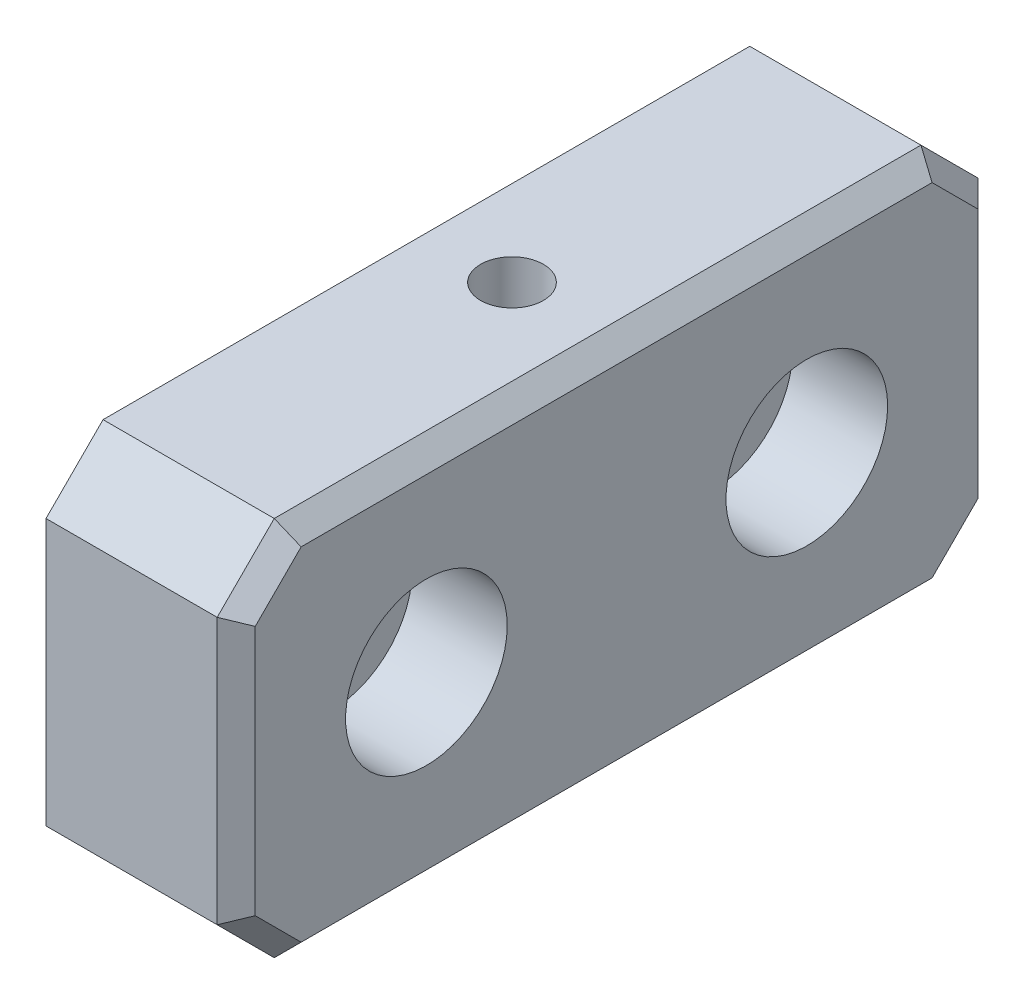
ISO-10303-21;
HEADER;
FILE_DESCRIPTION(('STEP AP214'),'2;1');
FILE_NAME('part.step','',(''),(''),'','','');
FILE_SCHEMA(('AUTOMOTIVE_DESIGN { 1 0 10303 214 1 1 1 1 }'));
ENDSEC;
DATA;
#1=APPLICATION_CONTEXT('core data for automotive mechanical design processes');
#2=APPLICATION_PROTOCOL_DEFINITION('international standard','automotive_design',2000,#1);
#3=PRODUCT_CONTEXT('',#1,'mechanical');
#4=PRODUCT('Part','Part','',(#3));
#5=PRODUCT_RELATED_PRODUCT_CATEGORY('part','',(#4));
#6=PRODUCT_DEFINITION_FORMATION('','',#4);
#7=PRODUCT_DEFINITION_CONTEXT('part definition',#1,'design');
#8=PRODUCT_DEFINITION('design','',#6,#7);
#9=PRODUCT_DEFINITION_SHAPE('','',#8);
#10=(LENGTH_UNIT() NAMED_UNIT(*) SI_UNIT(.MILLI.,.METRE.));
#11=(NAMED_UNIT(*) PLANE_ANGLE_UNIT() SI_UNIT($,.RADIAN.));
#12=(NAMED_UNIT(*) SI_UNIT($,.STERADIAN.) SOLID_ANGLE_UNIT());
#13=UNCERTAINTY_MEASURE_WITH_UNIT(LENGTH_MEASURE(1.E-05),#10,'distance_accuracy_value','');
#14=(GEOMETRIC_REPRESENTATION_CONTEXT(3) GLOBAL_UNCERTAINTY_ASSIGNED_CONTEXT((#13)) GLOBAL_UNIT_ASSIGNED_CONTEXT((#10,
#11,#12)) REPRESENTATION_CONTEXT('',''));
#15=CARTESIAN_POINT('',(0.,0.,0.));
#16=DIRECTION('',(0.,0.,1.));
#17=DIRECTION('',(1.,0.,0.));
#18=AXIS2_PLACEMENT_3D('',#15,#16,#17);
#19=CARTESIAN_POINT('',(10.,0.,0.));
#20=DIRECTION('',(1.,0.,0.));
#21=DIRECTION('',(0.,0.,-1.));
#22=AXIS2_PLACEMENT_3D('',#19,#20,#21);
#23=PLANE('',#22);
#24=DIRECTION('',(0.,0.,-1.));
#25=VECTOR('',#24,1.);
#26=CARTESIAN_POINT('',(10.,-9.00000000000001,-17.));
#27=LINE('',#26,#25);
#28=CARTESIAN_POINT('',(10.,-9.00000000000001,16.5857864376269));
#29=VERTEX_POINT('',#28);
#30=CARTESIAN_POINT('',(10.,-9.00000000000001,-16.5857864376269));
#31=VERTEX_POINT('',#30);
#32=EDGE_CURVE('E229',#29,#31,#27,.T.);
#33=ORIENTED_EDGE('',*,*,#32,.T.);
#34=DIRECTION('',(0.,0.707106781186547,-0.707106781186548));
#35=VECTOR('',#34,1.);
#36=CARTESIAN_POINT('',(10.,-12.7928932188135,-12.7928932188135));
#37=LINE('',#36,#35);
#38=CARTESIAN_POINT('',(10.,-6.58578643762691,-19.));
#39=VERTEX_POINT('',#38);
#40=EDGE_CURVE('E232',#31,#39,#37,.T.);
#41=ORIENTED_EDGE('',*,*,#40,.T.);
#42=DIRECTION('',(0.,1.,0.));
#43=VECTOR('',#42,1.);
#44=CARTESIAN_POINT('',(10.,6.99999999999997,-19.0000000000001));
#45=LINE('',#44,#43);
#46=CARTESIAN_POINT('',(10.,6.58578643762688,-19.0000000000001));
#47=VERTEX_POINT('',#46);
#48=EDGE_CURVE('E211',#39,#47,#45,.T.);
#49=ORIENTED_EDGE('',*,*,#48,.T.);
#50=DIRECTION('',(0.,0.70710678118655,0.707106781186546));
#51=VECTOR('',#50,1.);
#52=CARTESIAN_POINT('',(10.,12.7928932188134,-12.7928932188135));
#53=LINE('',#52,#51);
#54=CARTESIAN_POINT('',(10.,9.,-16.5857864376269));
#55=VERTEX_POINT('',#54);
#56=EDGE_CURVE('E214',#47,#55,#53,.T.);
#57=ORIENTED_EDGE('',*,*,#56,.T.);
#58=DIRECTION('',(0.,0.,1.));
#59=VECTOR('',#58,1.);
#60=CARTESIAN_POINT('',(10.,8.99999999999999,17.));
#61=LINE('',#60,#59);
#62=CARTESIAN_POINT('',(10.,8.99999999999999,16.5857864376269));
#63=VERTEX_POINT('',#62);
#64=EDGE_CURVE('E217',#55,#63,#61,.T.);
#65=ORIENTED_EDGE('',*,*,#64,.T.);
#66=DIRECTION('',(0.,-0.707106781186547,0.707106781186549));
#67=VECTOR('',#66,1.);
#68=CARTESIAN_POINT('',(10.,12.7928932188135,12.7928932188134));
#69=LINE('',#68,#67);
#70=CARTESIAN_POINT('',(10.,6.58578643762689,19.));
#71=VERTEX_POINT('',#70);
#72=EDGE_CURVE('E220',#63,#71,#69,.T.);
#73=ORIENTED_EDGE('',*,*,#72,.T.);
#74=DIRECTION('',(0.,-1.,0.));
#75=VECTOR('',#74,1.);
#76=CARTESIAN_POINT('',(10.,-7.,19.));
#77=LINE('',#76,#75);
#78=CARTESIAN_POINT('',(10.,-6.5857864376269,19.));
#79=VERTEX_POINT('',#78);
#80=EDGE_CURVE('E223',#71,#79,#77,.T.);
#81=ORIENTED_EDGE('',*,*,#80,.T.);
#82=DIRECTION('',(0.,-0.707106781186549,-0.707106781186546));
#83=VECTOR('',#82,1.);
#84=CARTESIAN_POINT('',(10.,-12.7928932188134,12.7928932188134));
#85=LINE('',#84,#83);
#86=EDGE_CURVE('E226',#79,#29,#85,.T.);
#87=ORIENTED_EDGE('',*,*,#86,.T.);
#88=EDGE_LOOP('',(#33,#41,#49,#57,#65,#73,#81,#87));
#89=FACE_BOUND('',#88,.T.);
#90=CARTESIAN_POINT('',(10.,0.,-10.0000000000001));
#91=DIRECTION('',(1.,0.,0.));
#92=DIRECTION('',(0.,0.,-1.));
#93=AXIS2_PLACEMENT_3D('',#90,#91,#92);
#94=CIRCLE('',#93,4.25);
#95=CARTESIAN_POINT('',(10.,0.,-14.2500000000001));
#96=VERTEX_POINT('',#95);
#97=EDGE_CURVE('E540',#96,#96,#94,.F.);
#98=ORIENTED_EDGE('',*,*,#97,.T.);
#99=EDGE_LOOP('',(#98));
#100=FACE_BOUND('',#99,.T.);
#101=CARTESIAN_POINT('',(10.,0.,9.99999999999995));
#102=DIRECTION('',(1.,0.,0.));
#103=DIRECTION('',(0.,0.,-1.));
#104=AXIS2_PLACEMENT_3D('',#101,#102,#103);
#105=CIRCLE('',#104,4.25);
#106=CARTESIAN_POINT('',(10.,0.,5.74999999999995));
#107=VERTEX_POINT('',#106);
#108=EDGE_CURVE('E528',#107,#107,#105,.T.);
#109=ORIENTED_EDGE('',*,*,#108,.F.);
#110=EDGE_LOOP('',(#109));
#111=FACE_BOUND('',#110,.T.);
#112=ADVANCED_FACE('F52',(#89,#100,#111),#23,.T.);
#113=CARTESIAN_POINT('',(0.,0.,-10.0000000000001));
#114=DIRECTION('',(1.,0.,0.));
#115=DIRECTION('',(0.,0.,-1.));
#116=AXIS2_PLACEMENT_3D('',#113,#114,#115);
#117=CYLINDRICAL_SURFACE('',#116,2.25);
#118=CARTESIAN_POINT('',(0.,0.,-10.0000000000001));
#119=DIRECTION('',(1.,0.,0.));
#120=DIRECTION('',(0.,0.,-1.));
#121=AXIS2_PLACEMENT_3D('',#118,#119,#120);
#122=CIRCLE('',#121,2.25);
#123=CARTESIAN_POINT('',(0.,0.,-12.2500000000001));
#124=VERTEX_POINT('',#123);
#125=EDGE_CURVE('E520',#124,#124,#122,.F.);
#126=ORIENTED_EDGE('',*,*,#125,.T.);
#127=EDGE_LOOP('',(#126));
#128=FACE_BOUND('',#127,.T.);
#129=CARTESIAN_POINT('',(5.,0.,-10.0000000000001));
#130=DIRECTION('',(1.,0.,0.));
#131=DIRECTION('',(0.,0.,-1.));
#132=AXIS2_PLACEMENT_3D('',#129,#130,#131);
#133=CIRCLE('',#132,2.25);
#134=CARTESIAN_POINT('',(5.,0.,-12.2500000000001));
#135=VERTEX_POINT('',#134);
#136=EDGE_CURVE('E536',#135,#135,#133,.F.);
#137=ORIENTED_EDGE('',*,*,#136,.F.);
#138=EDGE_LOOP('',(#137));
#139=FACE_BOUND('',#138,.T.);
#140=ADVANCED_FACE('F355',(#128,#139),#117,.F.);
#141=CARTESIAN_POINT('',(0.,0.,9.99999999999995));
#142=DIRECTION('',(1.,0.,0.));
#143=DIRECTION('',(0.,0.,-1.));
#144=AXIS2_PLACEMENT_3D('',#141,#142,#143);
#145=CYLINDRICAL_SURFACE('',#144,2.25);
#146=CARTESIAN_POINT('',(0.,0.,9.99999999999995));
#147=DIRECTION('',(1.,0.,0.));
#148=DIRECTION('',(0.,0.,-1.));
#149=AXIS2_PLACEMENT_3D('',#146,#147,#148);
#150=CIRCLE('',#149,2.25);
#151=CARTESIAN_POINT('',(0.,0.,7.74999999999995));
#152=VERTEX_POINT('',#151);
#153=EDGE_CURVE('E260',#152,#152,#150,.T.);
#154=ORIENTED_EDGE('',*,*,#153,.F.);
#155=EDGE_LOOP('',(#154));
#156=FACE_BOUND('',#155,.T.);
#157=CARTESIAN_POINT('',(5.,0.,9.99999999999995));
#158=DIRECTION('',(1.,0.,0.));
#159=DIRECTION('',(0.,0.,-1.));
#160=AXIS2_PLACEMENT_3D('',#157,#158,#159);
#161=CIRCLE('',#160,2.25);
#162=CARTESIAN_POINT('',(5.,0.,7.74999999999995));
#163=VERTEX_POINT('',#162);
#164=EDGE_CURVE('E517',#163,#163,#161,.T.);
#165=ORIENTED_EDGE('',*,*,#164,.T.);
#166=EDGE_LOOP('',(#165));
#167=FACE_BOUND('',#166,.T.);
#168=ADVANCED_FACE('F360',(#156,#167),#145,.F.);
#169=CARTESIAN_POINT('',(0.,0.,0.));
#170=DIRECTION('',(1.,0.,0.));
#171=DIRECTION('',(0.,0.,-1.));
#172=AXIS2_PLACEMENT_3D('',#169,#170,#171);
#173=PLANE('',#172);
#174=DIRECTION('',(0.,0.,1.));
#175=VECTOR('',#174,1.);
#176=CARTESIAN_POINT('',(0.,10.,20.));
#177=LINE('',#176,#175);
#178=CARTESIAN_POINT('',(0.,10.,-17.0000000000001));
#179=VERTEX_POINT('',#178);
#180=CARTESIAN_POINT('',(0.,10.,17.));
#181=VERTEX_POINT('',#180);
#182=EDGE_CURVE('E147',#179,#181,#177,.T.);
#183=ORIENTED_EDGE('',*,*,#182,.F.);
#184=DIRECTION('',(0.,0.70710678118655,0.707106781186546));
#185=VECTOR('',#184,1.);
#186=CARTESIAN_POINT('',(0.,10.,-17.0000000000001));
#187=LINE('',#186,#185);
#188=CARTESIAN_POINT('',(0.,6.99999999999997,-20.0000000000001));
#189=VERTEX_POINT('',#188);
#190=EDGE_CURVE('E154',#179,#189,#187,.F.);
#191=ORIENTED_EDGE('',*,*,#190,.T.);
#192=DIRECTION('',(0.,1.,0.));
#193=VECTOR('',#192,1.);
#194=CARTESIAN_POINT('',(0.,10.,-20.0000000000001));
#195=LINE('',#194,#193);
#196=CARTESIAN_POINT('',(0.,-7.00000000000001,-20.0000000000001));
#197=VERTEX_POINT('',#196);
#198=EDGE_CURVE('E170',#197,#189,#195,.T.);
#199=ORIENTED_EDGE('',*,*,#198,.F.);
#200=DIRECTION('',(0.,0.707106781186547,-0.707106781186548));
#201=VECTOR('',#200,1.);
#202=CARTESIAN_POINT('',(0.,-7.00000000000001,-20.0000000000001));
#203=LINE('',#202,#201);
#204=CARTESIAN_POINT('',(0.,-10.,-17.0000000000001));
#205=VERTEX_POINT('',#204);
#206=EDGE_CURVE('E162',#197,#205,#203,.F.);
#207=ORIENTED_EDGE('',*,*,#206,.T.);
#208=DIRECTION('',(0.,0.,-1.));
#209=VECTOR('',#208,1.);
#210=CARTESIAN_POINT('',(0.,-10.,20.));
#211=LINE('',#210,#209);
#212=CARTESIAN_POINT('',(0.,-10.,17.));
#213=VERTEX_POINT('',#212);
#214=EDGE_CURVE('E176',#213,#205,#211,.T.);
#215=ORIENTED_EDGE('',*,*,#214,.F.);
#216=DIRECTION('',(0.,-0.707106781186549,-0.707106781186546));
#217=VECTOR('',#216,1.);
#218=CARTESIAN_POINT('',(0.,-10.,17.));
#219=LINE('',#218,#217);
#220=CARTESIAN_POINT('',(0.,-7.,20.));
#221=VERTEX_POINT('',#220);
#222=EDGE_CURVE('E188',#213,#221,#219,.F.);
#223=ORIENTED_EDGE('',*,*,#222,.T.);
#224=DIRECTION('',(0.,-1.,0.));
#225=VECTOR('',#224,1.);
#226=CARTESIAN_POINT('',(0.,10.,20.));
#227=LINE('',#226,#225);
#228=CARTESIAN_POINT('',(0.,6.99999999999999,20.));
#229=VERTEX_POINT('',#228);
#230=EDGE_CURVE('E169',#229,#221,#227,.T.);
#231=ORIENTED_EDGE('',*,*,#230,.F.);
#232=DIRECTION('',(0.,-0.707106781186547,0.707106781186549));
#233=VECTOR('',#232,1.);
#234=CARTESIAN_POINT('',(0.,6.99999999999999,20.));
#235=LINE('',#234,#233);
#236=EDGE_CURVE('E151',#229,#181,#235,.F.);
#237=ORIENTED_EDGE('',*,*,#236,.T.);
#238=EDGE_LOOP('',(#183,#191,#199,#207,#215,#223,#231,#237));
#239=FACE_BOUND('',#238,.T.);
#240=ORIENTED_EDGE('',*,*,#125,.F.);
#241=EDGE_LOOP('',(#240));
#242=FACE_BOUND('',#241,.T.);
#243=ORIENTED_EDGE('',*,*,#153,.T.);
#244=EDGE_LOOP('',(#243));
#245=FACE_BOUND('',#244,.T.);
#246=ADVANCED_FACE('F164',(#239,#242,#245),#173,.F.);
#247=CARTESIAN_POINT('',(10.,9.99999999999999,-20.0000000000001));
#248=DIRECTION('',(0.,0.,1.));
#249=DIRECTION('',(1.,0.,0.));
#250=AXIS2_PLACEMENT_3D('',#247,#248,#249);
#251=PLANE('',#250);
#252=DIRECTION('',(1.,0.,0.));
#253=VECTOR('',#252,1.);
#254=CARTESIAN_POINT('',(10.,6.99999999999996,-20.0000000000001));
#255=LINE('',#254,#253);
#256=CARTESIAN_POINT('',(9.00000000000001,6.99999999999996,-20.0000000000001));
#257=VERTEX_POINT('',#256);
#258=EDGE_CURVE('E156',#189,#257,#255,.T.);
#259=ORIENTED_EDGE('',*,*,#258,.T.);
#260=DIRECTION('',(0.,-1.,0.));
#261=VECTOR('',#260,1.);
#262=CARTESIAN_POINT('',(9.00000000000001,-7.00000000000001,-20.0000000000001));
#263=LINE('',#262,#261);
#264=CARTESIAN_POINT('',(9.00000000000001,-7.00000000000001,-20.0000000000001));
#265=VERTEX_POINT('',#264);
#266=EDGE_CURVE('E13',#257,#265,#263,.T.);
#267=ORIENTED_EDGE('',*,*,#266,.T.);
#268=DIRECTION('',(-1.,0.,0.));
#269=VECTOR('',#268,1.);
#270=CARTESIAN_POINT('',(10.,-7.00000000000001,-20.0000000000001));
#271=LINE('',#270,#269);
#272=EDGE_CURVE('E161',#265,#197,#271,.T.);
#273=ORIENTED_EDGE('',*,*,#272,.T.);
#274=ORIENTED_EDGE('',*,*,#198,.T.);
#275=EDGE_LOOP('',(#259,#267,#273,#274));
#276=FACE_BOUND('',#275,.T.);
#277=ADVANCED_FACE('F333',(#276),#251,.F.);
#278=CARTESIAN_POINT('',(10.,10.,20.));
#279=DIRECTION('',(0.,-1.,0.));
#280=DIRECTION('',(0.,0.,-1.));
#281=AXIS2_PLACEMENT_3D('',#278,#279,#280);
#282=PLANE('',#281);
#283=CARTESIAN_POINT('',(4.5,10.,0.));
#284=DIRECTION('',(0.,1.,0.));
#285=DIRECTION('',(0.,0.,1.));
#286=AXIS2_PLACEMENT_3D('',#283,#284,#285);
#287=CIRCLE('',#286,1.65);
#288=CARTESIAN_POINT('',(4.5,10.,1.64999999999995));
#289=VERTEX_POINT('',#288);
#290=EDGE_CURVE('E561',#289,#289,#287,.T.);
#291=ORIENTED_EDGE('',*,*,#290,.F.);
#292=EDGE_LOOP('',(#291));
#293=FACE_BOUND('',#292,.T.);
#294=DIRECTION('',(1.,0.,0.));
#295=VECTOR('',#294,1.);
#296=CARTESIAN_POINT('',(10.,9.99999999999999,17.));
#297=LINE('',#296,#295);
#298=CARTESIAN_POINT('',(9.00000000000001,9.99999999999999,17.));
#299=VERTEX_POINT('',#298);
#300=EDGE_CURVE('E152',#181,#299,#297,.T.);
#301=ORIENTED_EDGE('',*,*,#300,.T.);
#302=DIRECTION('',(0.,0.,-1.));
#303=VECTOR('',#302,1.);
#304=CARTESIAN_POINT('',(9.00000000000001,10.,-17.0000000000001));
#305=LINE('',#304,#303);
#306=CARTESIAN_POINT('',(9.00000000000001,10.,-17.0000000000001));
#307=VERTEX_POINT('',#306);
#308=EDGE_CURVE('E78',#299,#307,#305,.T.);
#309=ORIENTED_EDGE('',*,*,#308,.T.);
#310=DIRECTION('',(-1.,0.,0.));
#311=VECTOR('',#310,1.);
#312=CARTESIAN_POINT('',(10.,10.,-17.0000000000001));
#313=LINE('',#312,#311);
#314=EDGE_CURVE('E143',#307,#179,#313,.T.);
#315=ORIENTED_EDGE('',*,*,#314,.T.);
#316=ORIENTED_EDGE('',*,*,#182,.T.);
#317=EDGE_LOOP('',(#301,#309,#315,#316));
#318=FACE_BOUND('',#317,.T.);
#319=ADVANCED_FACE('F145',(#293,#318),#282,.F.);
#320=CARTESIAN_POINT('',(10.,10.,20.));
#321=DIRECTION('',(0.,0.,-1.));
#322=DIRECTION('',(0.,1.,0.));
#323=AXIS2_PLACEMENT_3D('',#320,#321,#322);
#324=PLANE('',#323);
#325=DIRECTION('',(1.,0.,0.));
#326=VECTOR('',#325,1.);
#327=CARTESIAN_POINT('',(10.,-7.,20.));
#328=LINE('',#327,#326);
#329=CARTESIAN_POINT('',(9.00000000000001,-7.,20.));
#330=VERTEX_POINT('',#329);
#331=EDGE_CURVE('E207',#221,#330,#328,.T.);
#332=ORIENTED_EDGE('',*,*,#331,.T.);
#333=DIRECTION('',(0.,1.,0.));
#334=VECTOR('',#333,1.);
#335=CARTESIAN_POINT('',(9.00000000000001,6.99999999999999,20.));
#336=LINE('',#335,#334);
#337=CARTESIAN_POINT('',(9.00000000000001,6.99999999999999,20.));
#338=VERTEX_POINT('',#337);
#339=EDGE_CURVE('E246',#330,#338,#336,.T.);
#340=ORIENTED_EDGE('',*,*,#339,.T.);
#341=DIRECTION('',(-1.,0.,0.));
#342=VECTOR('',#341,1.);
#343=CARTESIAN_POINT('',(10.,6.99999999999999,20.));
#344=LINE('',#343,#342);
#345=EDGE_CURVE('E204',#338,#229,#344,.T.);
#346=ORIENTED_EDGE('',*,*,#345,.T.);
#347=ORIENTED_EDGE('',*,*,#230,.T.);
#348=EDGE_LOOP('',(#332,#340,#346,#347));
#349=FACE_BOUND('',#348,.T.);
#350=ADVANCED_FACE('F301',(#349),#324,.F.);
#351=CARTESIAN_POINT('',(10.,-10.,20.));
#352=DIRECTION('',(0.,1.,0.));
#353=DIRECTION('',(0.,0.,1.));
#354=AXIS2_PLACEMENT_3D('',#351,#352,#353);
#355=PLANE('',#354);
#356=DIRECTION('',(1.,0.,0.));
#357=VECTOR('',#356,1.);
#358=CARTESIAN_POINT('',(10.,-10.,-17.0000000000001));
#359=LINE('',#358,#357);
#360=CARTESIAN_POINT('',(9.00000000000001,-10.,-17.0000000000001));
#361=VERTEX_POINT('',#360);
#362=EDGE_CURVE('E200',#205,#361,#359,.T.);
#363=ORIENTED_EDGE('',*,*,#362,.T.);
#364=DIRECTION('',(0.,0.,1.));
#365=VECTOR('',#364,1.);
#366=CARTESIAN_POINT('',(9.00000000000001,-10.,17.));
#367=LINE('',#366,#365);
#368=CARTESIAN_POINT('',(9.00000000000001,-10.,17.));
#369=VERTEX_POINT('',#368);
#370=EDGE_CURVE('E240',#361,#369,#367,.T.);
#371=ORIENTED_EDGE('',*,*,#370,.T.);
#372=DIRECTION('',(-1.,0.,0.));
#373=VECTOR('',#372,1.);
#374=CARTESIAN_POINT('',(10.,-10.,17.));
#375=LINE('',#374,#373);
#376=EDGE_CURVE('E197',#369,#213,#375,.T.);
#377=ORIENTED_EDGE('',*,*,#376,.T.);
#378=ORIENTED_EDGE('',*,*,#214,.T.);
#379=EDGE_LOOP('',(#363,#371,#377,#378));
#380=FACE_BOUND('',#379,.T.);
#381=ADVANCED_FACE('F367',(#380),#355,.F.);
#382=CARTESIAN_POINT('',(10.,10.,-17.0000000000001));
#383=DIRECTION('',(0.,-0.707106781186546,0.707106781186549));
#384=DIRECTION('',(-1.,0.,0.));
#385=AXIS2_PLACEMENT_3D('',#382,#383,#384);
#386=PLANE('',#385);
#387=ORIENTED_EDGE('',*,*,#314,.F.);
#388=DIRECTION('',(0.,0.70710678118655,0.707106781186546));
#389=VECTOR('',#388,1.);
#390=CARTESIAN_POINT('',(9.00000000000001,10.,-17.0000000000001));
#391=LINE('',#390,#389);
#392=EDGE_CURVE('E63',#307,#257,#391,.F.);
#393=ORIENTED_EDGE('',*,*,#392,.T.);
#394=ORIENTED_EDGE('',*,*,#258,.F.);
#395=ORIENTED_EDGE('',*,*,#190,.F.);
#396=EDGE_LOOP('',(#387,#393,#394,#395));
#397=FACE_BOUND('',#396,.T.);
#398=ADVANCED_FACE('F155',(#397),#386,.F.);
#399=CARTESIAN_POINT('',(10.,-7.00000000000001,-20.0000000000001));
#400=DIRECTION('',(0.,0.707106781186548,0.707106781186547));
#401=DIRECTION('',(-1.,0.,0.));
#402=AXIS2_PLACEMENT_3D('',#399,#400,#401);
#403=PLANE('',#402);
#404=ORIENTED_EDGE('',*,*,#272,.F.);
#405=DIRECTION('',(0.,0.707106781186547,-0.707106781186548));
#406=VECTOR('',#405,1.);
#407=CARTESIAN_POINT('',(9.00000000000001,-7.00000000000001,-20.0000000000001));
#408=LINE('',#407,#406);
#409=EDGE_CURVE('E236',#265,#361,#408,.F.);
#410=ORIENTED_EDGE('',*,*,#409,.T.);
#411=ORIENTED_EDGE('',*,*,#362,.F.);
#412=ORIENTED_EDGE('',*,*,#206,.F.);
#413=EDGE_LOOP('',(#404,#410,#411,#412));
#414=FACE_BOUND('',#413,.T.);
#415=ADVANCED_FACE('F337',(#414),#403,.F.);
#416=CARTESIAN_POINT('',(10.,-10.,17.));
#417=DIRECTION('',(0.,0.707106781186546,-0.707106781186549));
#418=DIRECTION('',(-1.,0.,0.));
#419=AXIS2_PLACEMENT_3D('',#416,#417,#418);
#420=PLANE('',#419);
#421=ORIENTED_EDGE('',*,*,#376,.F.);
#422=DIRECTION('',(0.,-0.707106781186549,-0.707106781186546));
#423=VECTOR('',#422,1.);
#424=CARTESIAN_POINT('',(9.00000000000001,-10.,17.));
#425=LINE('',#424,#423);
#426=EDGE_CURVE('E243',#369,#330,#425,.F.);
#427=ORIENTED_EDGE('',*,*,#426,.T.);
#428=ORIENTED_EDGE('',*,*,#331,.F.);
#429=ORIENTED_EDGE('',*,*,#222,.F.);
#430=EDGE_LOOP('',(#421,#427,#428,#429));
#431=FACE_BOUND('',#430,.T.);
#432=ADVANCED_FACE('F306',(#431),#420,.F.);
#433=CARTESIAN_POINT('',(10.,6.99999999999999,20.));
#434=DIRECTION('',(0.,-0.707106781186549,-0.707106781186547));
#435=DIRECTION('',(-1.,0.,0.));
#436=AXIS2_PLACEMENT_3D('',#433,#434,#435);
#437=PLANE('',#436);
#438=ORIENTED_EDGE('',*,*,#345,.F.);
#439=DIRECTION('',(0.,-0.707106781186547,0.707106781186549));
#440=VECTOR('',#439,1.);
#441=CARTESIAN_POINT('',(9.00000000000001,6.99999999999999,20.));
#442=LINE('',#441,#440);
#443=EDGE_CURVE('E249',#338,#299,#442,.F.);
#444=ORIENTED_EDGE('',*,*,#443,.T.);
#445=ORIENTED_EDGE('',*,*,#300,.F.);
#446=ORIENTED_EDGE('',*,*,#236,.F.);
#447=EDGE_LOOP('',(#438,#444,#445,#446));
#448=FACE_BOUND('',#447,.T.);
#449=ADVANCED_FACE('F299',(#448),#437,.F.);
#450=CARTESIAN_POINT('',(10.,12.7928932188135,12.7928932188134));
#451=DIRECTION('',(0.707106781186546,0.500000000000002,0.500000000000001));
#452=DIRECTION('',(0.,0.707106781186547,-0.707106781186549));
#453=AXIS2_PLACEMENT_3D('',#450,#451,#452);
#454=PLANE('',#453);
#455=DIRECTION('',(0.678598344545849,-0.678598344545845,-0.281084637714821));
#456=VECTOR('',#455,1.);
#457=CARTESIAN_POINT('',(13.16363211356,5.83636788643998,15.2753671098312));
#458=LINE('',#457,#456);
#459=EDGE_CURVE('E278',#299,#63,#458,.T.);
#460=ORIENTED_EDGE('',*,*,#459,.F.);
#461=ORIENTED_EDGE('',*,*,#443,.F.);
#462=DIRECTION('',(0.67859834454585,-0.281084637714826,-0.678598344545842));
#463=VECTOR('',#462,1.);
#464=CARTESIAN_POINT('',(11.6743803584745,5.8922353845756,17.3256196415255));
#465=LINE('',#464,#463);
#466=EDGE_CURVE('E57',#71,#338,#465,.F.);
#467=ORIENTED_EDGE('',*,*,#466,.F.);
#468=ORIENTED_EDGE('',*,*,#72,.F.);
#469=EDGE_LOOP('',(#460,#461,#467,#468));
#470=FACE_BOUND('',#469,.T.);
#471=ADVANCED_FACE('F55',(#470),#454,.T.);
#472=CARTESIAN_POINT('',(10.,0.,19.));
#473=DIRECTION('',(0.707106781186543,0.,0.707106781186552));
#474=DIRECTION('',(0.,1.,0.));
#475=AXIS2_PLACEMENT_3D('',#472,#473,#474);
#476=PLANE('',#475);
#477=ORIENTED_EDGE('',*,*,#466,.T.);
#478=ORIENTED_EDGE('',*,*,#339,.F.);
#479=DIRECTION('',(0.678598344545851,0.281084637714823,-0.678598344545842));
#480=VECTOR('',#479,1.);
#481=CARTESIAN_POINT('',(11.2561964152545,-6.06545284542399,17.7438035847454));
#482=LINE('',#481,#480);
#483=EDGE_CURVE('E275',#79,#330,#482,.F.);
#484=ORIENTED_EDGE('',*,*,#483,.F.);
#485=ORIENTED_EDGE('',*,*,#80,.F.);
#486=EDGE_LOOP('',(#477,#478,#484,#485));
#487=FACE_BOUND('',#486,.T.);
#488=ADVANCED_FACE('F292',(#487),#476,.T.);
#489=CARTESIAN_POINT('',(10.,9.,0.));
#490=DIRECTION('',(0.707106781186545,0.70710678118655,0.));
#491=DIRECTION('',(0.,0.,-1.));
#492=AXIS2_PLACEMENT_3D('',#489,#490,#491);
#493=PLANE('',#492);
#494=ORIENTED_EDGE('',*,*,#459,.T.);
#495=ORIENTED_EDGE('',*,*,#64,.F.);
#496=DIRECTION('',(0.678598344545849,-0.678598344545845,0.28108463771482));
#497=VECTOR('',#496,1.);
#498=CARTESIAN_POINT('',(8.97685892457639,10.0231410754236,-17.0095853472884));
#499=LINE('',#498,#497);
#500=EDGE_CURVE('E271',#307,#55,#499,.T.);
#501=ORIENTED_EDGE('',*,*,#500,.F.);
#502=ORIENTED_EDGE('',*,*,#308,.F.);
#503=EDGE_LOOP('',(#494,#495,#501,#502));
#504=FACE_BOUND('',#503,.T.);
#505=ADVANCED_FACE('F322',(#504),#493,.T.);
#506=CARTESIAN_POINT('',(10.,-12.7928932188134,12.7928932188134));
#507=DIRECTION('',(0.707106781186545,-0.5,0.500000000000003));
#508=DIRECTION('',(0.,0.707106781186549,0.707106781186546));
#509=AXIS2_PLACEMENT_3D('',#506,#507,#508);
#510=PLANE('',#509);
#511=ORIENTED_EDGE('',*,*,#483,.T.);
#512=ORIENTED_EDGE('',*,*,#426,.F.);
#513=DIRECTION('',(0.678598344545849,0.678598344545845,-0.281084637714821));
#514=VECTOR('',#513,1.);
#515=CARTESIAN_POINT('',(8.97685892457639,-10.0231410754236,17.0095853472884));
#516=LINE('',#515,#514);
#517=EDGE_CURVE('E267',#29,#369,#516,.F.);
#518=ORIENTED_EDGE('',*,*,#517,.F.);
#519=ORIENTED_EDGE('',*,*,#86,.F.);
#520=EDGE_LOOP('',(#511,#512,#518,#519));
#521=FACE_BOUND('',#520,.T.);
#522=ADVANCED_FACE('F311',(#521),#510,.T.);
#523=CARTESIAN_POINT('',(10.,12.7928932188134,-12.7928932188135));
#524=DIRECTION('',(0.707106781186545,0.500000000000001,-0.500000000000003));
#525=DIRECTION('',(0.,-0.70710678118655,-0.707106781186546));
#526=AXIS2_PLACEMENT_3D('',#523,#524,#525);
#527=PLANE('',#526);
#528=ORIENTED_EDGE('',*,*,#500,.T.);
#529=ORIENTED_EDGE('',*,*,#56,.F.);
#530=DIRECTION('',(0.67859834454585,-0.281084637714819,0.678598344545845));
#531=VECTOR('',#530,1.);
#532=CARTESIAN_POINT('',(11.2561964152545,6.06545284542398,-17.7438035847455));
#533=LINE('',#532,#531);
#534=EDGE_CURVE('E263',#257,#47,#533,.T.);
#535=ORIENTED_EDGE('',*,*,#534,.F.);
#536=ORIENTED_EDGE('',*,*,#392,.F.);
#537=EDGE_LOOP('',(#528,#529,#535,#536));
#538=FACE_BOUND('',#537,.T.);
#539=ADVANCED_FACE('F324',(#538),#527,.T.);
#540=CARTESIAN_POINT('',(10.,-9.00000000000001,0.));
#541=DIRECTION('',(0.707106781186545,-0.70710678118655,0.));
#542=DIRECTION('',(0.,0.,1.));
#543=AXIS2_PLACEMENT_3D('',#540,#541,#542);
#544=PLANE('',#543);
#545=ORIENTED_EDGE('',*,*,#517,.T.);
#546=ORIENTED_EDGE('',*,*,#370,.F.);
#547=DIRECTION('',(0.67859834454585,0.678598344545845,0.281084637714819));
#548=VECTOR('',#547,1.);
#549=CARTESIAN_POINT('',(13.16363211356,-5.83636788644002,-15.2753671098313));
#550=LINE('',#549,#548);
#551=EDGE_CURVE('E259',#31,#361,#550,.F.);
#552=ORIENTED_EDGE('',*,*,#551,.F.);
#553=ORIENTED_EDGE('',*,*,#32,.F.);
#554=EDGE_LOOP('',(#545,#546,#552,#553));
#555=FACE_BOUND('',#554,.T.);
#556=ADVANCED_FACE('F316',(#555),#544,.T.);
#557=CARTESIAN_POINT('',(10.,0.,-19.0000000000001));
#558=DIRECTION('',(0.707106781186545,0.,-0.70710678118655));
#559=DIRECTION('',(0.,-1.,0.));
#560=AXIS2_PLACEMENT_3D('',#557,#558,#559);
#561=PLANE('',#560);
#562=ORIENTED_EDGE('',*,*,#534,.T.);
#563=ORIENTED_EDGE('',*,*,#48,.F.);
#564=DIRECTION('',(-0.67859834454585,-0.28108463771482,-0.678598344545845));
#565=VECTOR('',#564,1.);
#566=CARTESIAN_POINT('',(11.2561964152545,-6.06545284542401,-17.7438035847455));
#567=LINE('',#566,#565);
#568=EDGE_CURVE('E256',#265,#39,#567,.F.);
#569=ORIENTED_EDGE('',*,*,#568,.F.);
#570=ORIENTED_EDGE('',*,*,#266,.F.);
#571=EDGE_LOOP('',(#562,#563,#569,#570));
#572=FACE_BOUND('',#571,.T.);
#573=ADVANCED_FACE('F330',(#572),#561,.T.);
#574=CARTESIAN_POINT('',(10.,-12.7928932188135,-12.7928932188135));
#575=DIRECTION('',(0.707106781186545,-0.500000000000002,-0.500000000000002));
#576=DIRECTION('',(0.,-0.707106781186547,0.707106781186548));
#577=AXIS2_PLACEMENT_3D('',#574,#575,#576);
#578=PLANE('',#577);
#579=ORIENTED_EDGE('',*,*,#551,.T.);
#580=ORIENTED_EDGE('',*,*,#409,.F.);
#581=ORIENTED_EDGE('',*,*,#568,.T.);
#582=ORIENTED_EDGE('',*,*,#40,.F.);
#583=EDGE_LOOP('',(#579,#580,#581,#582));
#584=FACE_BOUND('',#583,.T.);
#585=ADVANCED_FACE('F340',(#584),#578,.T.);
#586=CARTESIAN_POINT('',(5.,0.,9.99999999999995));
#587=DIRECTION('',(1.,0.,0.));
#588=DIRECTION('',(0.,0.,-1.));
#589=AXIS2_PLACEMENT_3D('',#586,#587,#588);
#590=CYLINDRICAL_SURFACE('',#589,4.25);
#591=CARTESIAN_POINT('',(5.,0.,9.99999999999995));
#592=DIRECTION('',(1.,0.,0.));
#593=DIRECTION('',(0.,0.,-1.));
#594=AXIS2_PLACEMENT_3D('',#591,#592,#593);
#595=CIRCLE('',#594,4.25);
#596=CARTESIAN_POINT('',(5.,0.,5.74999999999995));
#597=VERTEX_POINT('',#596);
#598=EDGE_CURVE('E521',#597,#597,#595,.T.);
#599=ORIENTED_EDGE('',*,*,#598,.F.);
#600=EDGE_LOOP('',(#599));
#601=FACE_BOUND('',#600,.T.);
#602=ORIENTED_EDGE('',*,*,#108,.T.);
#603=EDGE_LOOP('',(#602));
#604=FACE_BOUND('',#603,.T.);
#605=ADVANCED_FACE('F342',(#601,#604),#590,.F.);
#606=CARTESIAN_POINT('',(5.,0.,0.));
#607=DIRECTION('',(1.,0.,0.));
#608=DIRECTION('',(0.,0.,-1.));
#609=AXIS2_PLACEMENT_3D('',#606,#607,#608);
#610=PLANE('',#609);
#611=ORIENTED_EDGE('',*,*,#598,.T.);
#612=EDGE_LOOP('',(#611));
#613=FACE_BOUND('',#612,.T.);
#614=ORIENTED_EDGE('',*,*,#164,.F.);
#615=EDGE_LOOP('',(#614));
#616=FACE_BOUND('',#615,.T.);
#617=ADVANCED_FACE('F348',(#613,#616),#610,.T.);
#618=CARTESIAN_POINT('',(5.,0.,-10.0000000000001));
#619=DIRECTION('',(1.,0.,0.));
#620=DIRECTION('',(0.,0.,-1.));
#621=AXIS2_PLACEMENT_3D('',#618,#619,#620);
#622=CYLINDRICAL_SURFACE('',#621,4.25);
#623=CARTESIAN_POINT('',(5.,0.,-10.0000000000001));
#624=DIRECTION('',(1.,0.,0.));
#625=DIRECTION('',(0.,0.,-1.));
#626=AXIS2_PLACEMENT_3D('',#623,#624,#625);
#627=CIRCLE('',#626,4.25);
#628=CARTESIAN_POINT('',(5.,0.,-14.2500000000001));
#629=VERTEX_POINT('',#628);
#630=EDGE_CURVE('E535',#629,#629,#627,.F.);
#631=ORIENTED_EDGE('',*,*,#630,.T.);
#632=EDGE_LOOP('',(#631));
#633=FACE_BOUND('',#632,.T.);
#634=ORIENTED_EDGE('',*,*,#97,.F.);
#635=EDGE_LOOP('',(#634));
#636=FACE_BOUND('',#635,.T.);
#637=ADVANCED_FACE('F462',(#633,#636),#622,.F.);
#638=CARTESIAN_POINT('',(5.,0.,0.));
#639=DIRECTION('',(1.,0.,0.));
#640=DIRECTION('',(0.,0.,-1.));
#641=AXIS2_PLACEMENT_3D('',#638,#639,#640);
#642=PLANE('',#641);
#643=ORIENTED_EDGE('',*,*,#136,.T.);
#644=EDGE_LOOP('',(#643));
#645=FACE_BOUND('',#644,.T.);
#646=ORIENTED_EDGE('',*,*,#630,.F.);
#647=EDGE_LOOP('',(#646));
#648=FACE_BOUND('',#647,.T.);
#649=ADVANCED_FACE('F472',(#645,#648),#642,.T.);
#650=CARTESIAN_POINT('',(4.5,5.,0.));
#651=DIRECTION('',(0.,1.,0.));
#652=DIRECTION('',(0.,0.,1.));
#653=AXIS2_PLACEMENT_3D('',#650,#651,#652);
#654=CYLINDRICAL_SURFACE('',#653,1.65);
#655=CARTESIAN_POINT('',(4.5,5.,0.));
#656=DIRECTION('',(0.,1.,0.));
#657=DIRECTION('',(0.,0.,1.));
#658=AXIS2_PLACEMENT_3D('',#655,#656,#657);
#659=CIRCLE('',#658,1.65);
#660=CARTESIAN_POINT('',(4.5,5.,1.64999999999995));
#661=VERTEX_POINT('',#660);
#662=EDGE_CURVE('E547',#661,#661,#659,.T.);
#663=ORIENTED_EDGE('',*,*,#662,.F.);
#664=EDGE_LOOP('',(#663));
#665=FACE_BOUND('',#664,.T.);
#666=ORIENTED_EDGE('',*,*,#290,.T.);
#667=EDGE_LOOP('',(#666));
#668=FACE_BOUND('',#667,.T.);
#669=ADVANCED_FACE('F483',(#665,#668),#654,.F.);
#670=CARTESIAN_POINT('',(4.5,5.,0.));
#671=DIRECTION('',(0.,1.,0.));
#672=DIRECTION('',(0.,0.,1.));
#673=AXIS2_PLACEMENT_3D('',#670,#671,#672);
#674=PLANE('',#673);
#675=ORIENTED_EDGE('',*,*,#662,.T.);
#676=EDGE_LOOP('',(#675));
#677=FACE_BOUND('',#676,.T.);
#678=ADVANCED_FACE('F493',(#677),#674,.T.);
#679=CLOSED_SHELL('',(#112,#140,#168,#246,#277,#319,#350,#381,#398,#415,#432,#449,#471,#488,
#505,#522,#539,#556,#573,#585,#605,#617,#637,#649,#669,#678));
#680=MANIFOLD_SOLID_BREP('B2',#679);
#681=ADVANCED_BREP_SHAPE_REPRESENTATION('',(#18,#680),#14);
#682=SHAPE_DEFINITION_REPRESENTATION(#9,#681);
ENDSEC;
END-ISO-10303-21;
